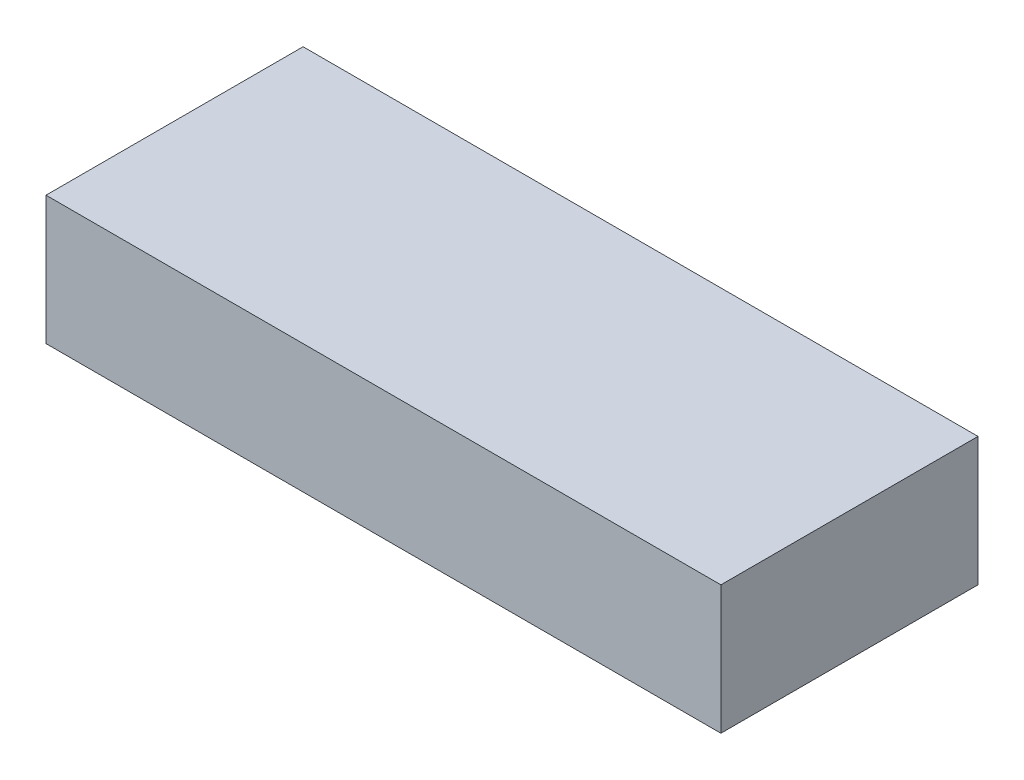
ISO-10303-21;
HEADER;
FILE_DESCRIPTION(('STEP AP214'),'2;1');
FILE_NAME('part.step','',(''),(''),'','','');
FILE_SCHEMA(('AUTOMOTIVE_DESIGN { 1 0 10303 214 1 1 1 1 }'));
ENDSEC;
DATA;
#1=APPLICATION_CONTEXT('core data for automotive mechanical design processes');
#2=APPLICATION_PROTOCOL_DEFINITION('international standard','automotive_design',2000,#1);
#3=PRODUCT_CONTEXT('',#1,'mechanical');
#4=PRODUCT('Part','Part','',(#3));
#5=PRODUCT_RELATED_PRODUCT_CATEGORY('part','',(#4));
#6=PRODUCT_DEFINITION_FORMATION('','',#4);
#7=PRODUCT_DEFINITION_CONTEXT('part definition',#1,'design');
#8=PRODUCT_DEFINITION('design','',#6,#7);
#9=PRODUCT_DEFINITION_SHAPE('','',#8);
#10=(LENGTH_UNIT() NAMED_UNIT(*) SI_UNIT(.MILLI.,.METRE.));
#11=(NAMED_UNIT(*) PLANE_ANGLE_UNIT() SI_UNIT($,.RADIAN.));
#12=(NAMED_UNIT(*) SI_UNIT($,.STERADIAN.) SOLID_ANGLE_UNIT());
#13=UNCERTAINTY_MEASURE_WITH_UNIT(LENGTH_MEASURE(1.E-05),#10,'distance_accuracy_value','');
#14=(GEOMETRIC_REPRESENTATION_CONTEXT(3) GLOBAL_UNCERTAINTY_ASSIGNED_CONTEXT((#13)) GLOBAL_UNIT_ASSIGNED_CONTEXT((#10,
#11,#12)) REPRESENTATION_CONTEXT('',''));
#15=CARTESIAN_POINT('',(0.,0.,0.));
#16=DIRECTION('',(0.,0.,1.));
#17=DIRECTION('',(1.,0.,0.));
#18=AXIS2_PLACEMENT_3D('',#15,#16,#17);
#19=CARTESIAN_POINT('',(66.675,25.4,25.4));
#20=DIRECTION('',(-1.,0.,0.));
#21=DIRECTION('',(0.,0.,1.));
#22=AXIS2_PLACEMENT_3D('',#19,#20,#21);
#23=PLANE('',#22);
#24=DIRECTION('',(0.,0.,-1.));
#25=VECTOR('',#24,1.);
#26=CARTESIAN_POINT('',(66.675,0.,25.4));
#27=LINE('',#26,#25);
#28=CARTESIAN_POINT('',(66.675,0.,25.4));
#29=VERTEX_POINT('',#28);
#30=CARTESIAN_POINT('',(66.675,0.,-25.4));
#31=VERTEX_POINT('',#30);
#32=EDGE_CURVE('E107',#29,#31,#27,.T.);
#33=ORIENTED_EDGE('',*,*,#32,.T.);
#34=DIRECTION('',(0.,-1.,0.));
#35=VECTOR('',#34,1.);
#36=CARTESIAN_POINT('',(66.675,25.4,-25.4));
#37=LINE('',#36,#35);
#38=CARTESIAN_POINT('',(66.675,25.4,-25.4));
#39=VERTEX_POINT('',#38);
#40=EDGE_CURVE('E11',#39,#31,#37,.T.);
#41=ORIENTED_EDGE('',*,*,#40,.F.);
#42=DIRECTION('',(0.,0.,-1.));
#43=VECTOR('',#42,1.);
#44=CARTESIAN_POINT('',(66.675,25.4,25.4));
#45=LINE('',#44,#43);
#46=CARTESIAN_POINT('',(66.675,25.4,25.4));
#47=VERTEX_POINT('',#46);
#48=EDGE_CURVE('E91',#47,#39,#45,.T.);
#49=ORIENTED_EDGE('',*,*,#48,.F.);
#50=DIRECTION('',(0.,-1.,0.));
#51=VECTOR('',#50,1.);
#52=CARTESIAN_POINT('',(66.675,25.4,25.4));
#53=LINE('',#52,#51);
#54=EDGE_CURVE('E103',#47,#29,#53,.T.);
#55=ORIENTED_EDGE('',*,*,#54,.T.);
#56=EDGE_LOOP('',(#33,#41,#49,#55));
#57=FACE_BOUND('',#56,.T.);
#58=ADVANCED_FACE('F39',(#57),#23,.F.);
#59=CARTESIAN_POINT('',(-66.675,25.4,-25.4));
#60=DIRECTION('',(0.,0.,1.));
#61=DIRECTION('',(1.,0.,0.));
#62=AXIS2_PLACEMENT_3D('',#59,#60,#61);
#63=PLANE('',#62);
#64=DIRECTION('',(-1.,0.,0.));
#65=VECTOR('',#64,1.);
#66=CARTESIAN_POINT('',(-66.675,0.,-25.4));
#67=LINE('',#66,#65);
#68=CARTESIAN_POINT('',(-66.675,0.,-25.4));
#69=VERTEX_POINT('',#68);
#70=EDGE_CURVE('E96',#31,#69,#67,.T.);
#71=ORIENTED_EDGE('',*,*,#70,.T.);
#72=DIRECTION('',(0.,-1.,0.));
#73=VECTOR('',#72,1.);
#74=CARTESIAN_POINT('',(-66.675,25.4,-25.4));
#75=LINE('',#74,#73);
#76=CARTESIAN_POINT('',(-66.675,25.4,-25.4));
#77=VERTEX_POINT('',#76);
#78=EDGE_CURVE('E48',#77,#69,#75,.T.);
#79=ORIENTED_EDGE('',*,*,#78,.F.);
#80=DIRECTION('',(-1.,0.,0.));
#81=VECTOR('',#80,1.);
#82=CARTESIAN_POINT('',(-66.675,25.4,-25.4));
#83=LINE('',#82,#81);
#84=EDGE_CURVE('E86',#39,#77,#83,.T.);
#85=ORIENTED_EDGE('',*,*,#84,.F.);
#86=ORIENTED_EDGE('',*,*,#40,.T.);
#87=EDGE_LOOP('',(#71,#79,#85,#86));
#88=FACE_BOUND('',#87,.T.);
#89=ADVANCED_FACE('F95',(#88),#63,.F.);
#90=CARTESIAN_POINT('',(-66.675,25.4,25.4));
#91=DIRECTION('',(1.,0.,0.));
#92=DIRECTION('',(0.,0.,-1.));
#93=AXIS2_PLACEMENT_3D('',#90,#91,#92);
#94=PLANE('',#93);
#95=DIRECTION('',(0.,0.,1.));
#96=VECTOR('',#95,1.);
#97=CARTESIAN_POINT('',(-66.675,0.,25.4));
#98=LINE('',#97,#96);
#99=CARTESIAN_POINT('',(-66.675,0.,25.4));
#100=VERTEX_POINT('',#99);
#101=EDGE_CURVE('E73',#69,#100,#98,.T.);
#102=ORIENTED_EDGE('',*,*,#101,.T.);
#103=DIRECTION('',(0.,-1.,0.));
#104=VECTOR('',#103,1.);
#105=CARTESIAN_POINT('',(-66.675,25.4,25.4));
#106=LINE('',#105,#104);
#107=CARTESIAN_POINT('',(-66.675,25.4,25.4));
#108=VERTEX_POINT('',#107);
#109=EDGE_CURVE('E98',#108,#100,#106,.T.);
#110=ORIENTED_EDGE('',*,*,#109,.F.);
#111=DIRECTION('',(0.,0.,1.));
#112=VECTOR('',#111,1.);
#113=CARTESIAN_POINT('',(-66.675,25.4,25.4));
#114=LINE('',#113,#112);
#115=EDGE_CURVE('E89',#77,#108,#114,.T.);
#116=ORIENTED_EDGE('',*,*,#115,.F.);
#117=ORIENTED_EDGE('',*,*,#78,.T.);
#118=EDGE_LOOP('',(#102,#110,#116,#117));
#119=FACE_BOUND('',#118,.T.);
#120=ADVANCED_FACE('F99',(#119),#94,.F.);
#121=CARTESIAN_POINT('',(-66.675,25.4,25.4));
#122=DIRECTION('',(0.,0.,-1.));
#123=DIRECTION('',(-1.,0.,0.));
#124=AXIS2_PLACEMENT_3D('',#121,#122,#123);
#125=PLANE('',#124);
#126=DIRECTION('',(1.,0.,0.));
#127=VECTOR('',#126,1.);
#128=CARTESIAN_POINT('',(-66.675,0.,25.4));
#129=LINE('',#128,#127);
#130=EDGE_CURVE('E79',#100,#29,#129,.T.);
#131=ORIENTED_EDGE('',*,*,#130,.T.);
#132=ORIENTED_EDGE('',*,*,#54,.F.);
#133=DIRECTION('',(1.,0.,0.));
#134=VECTOR('',#133,1.);
#135=CARTESIAN_POINT('',(-66.675,25.4,25.4));
#136=LINE('',#135,#134);
#137=EDGE_CURVE('E56',#108,#47,#136,.T.);
#138=ORIENTED_EDGE('',*,*,#137,.F.);
#139=ORIENTED_EDGE('',*,*,#109,.T.);
#140=EDGE_LOOP('',(#131,#132,#138,#139));
#141=FACE_BOUND('',#140,.T.);
#142=ADVANCED_FACE('F120',(#141),#125,.F.);
#143=CARTESIAN_POINT('',(0.,25.4,0.));
#144=DIRECTION('',(0.,-1.,0.));
#145=DIRECTION('',(0.,0.,-1.));
#146=AXIS2_PLACEMENT_3D('',#143,#144,#145);
#147=PLANE('',#146);
#148=ORIENTED_EDGE('',*,*,#48,.T.);
#149=ORIENTED_EDGE('',*,*,#84,.T.);
#150=ORIENTED_EDGE('',*,*,#115,.T.);
#151=ORIENTED_EDGE('',*,*,#137,.T.);
#152=EDGE_LOOP('',(#148,#149,#150,#151));
#153=FACE_BOUND('',#152,.T.);
#154=ADVANCED_FACE('F87',(#153),#147,.F.);
#155=CARTESIAN_POINT('',(0.,0.,0.));
#156=DIRECTION('',(0.,-1.,0.));
#157=DIRECTION('',(0.,0.,-1.));
#158=AXIS2_PLACEMENT_3D('',#155,#156,#157);
#159=PLANE('',#158);
#160=ORIENTED_EDGE('',*,*,#32,.F.);
#161=ORIENTED_EDGE('',*,*,#130,.F.);
#162=ORIENTED_EDGE('',*,*,#101,.F.);
#163=ORIENTED_EDGE('',*,*,#70,.F.);
#164=EDGE_LOOP('',(#160,#161,#162,#163));
#165=FACE_BOUND('',#164,.T.);
#166=ADVANCED_FACE('F123',(#165),#159,.T.);
#167=CLOSED_SHELL('',(#58,#89,#120,#142,#154,#166));
#168=MANIFOLD_SOLID_BREP('B2',#167);
#169=ADVANCED_BREP_SHAPE_REPRESENTATION('',(#18,#168),#14);
#170=SHAPE_DEFINITION_REPRESENTATION(#9,#169);
ENDSEC;
END-ISO-10303-21;
